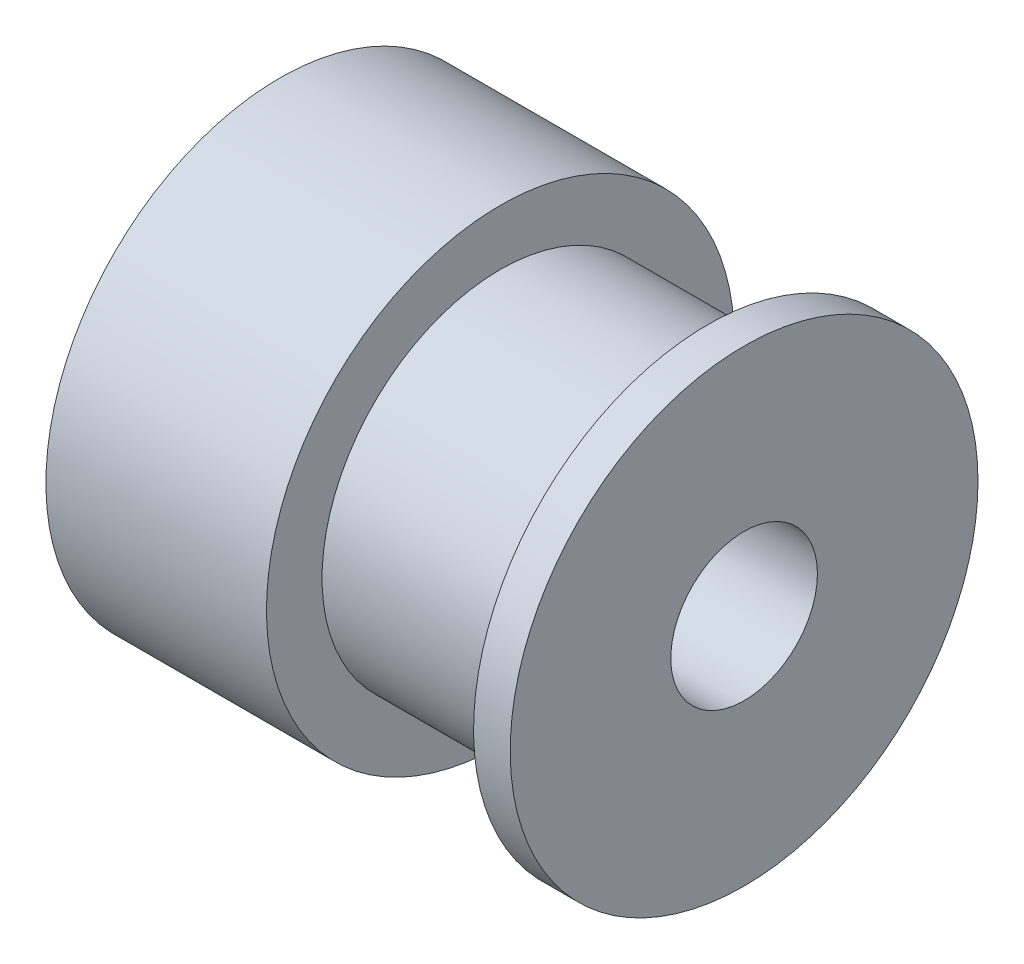
ISO-10303-21;
HEADER;
FILE_DESCRIPTION(('STEP AP214'),'2;1');
FILE_NAME('part.step','',(''),(''),'','','');
FILE_SCHEMA(('AUTOMOTIVE_DESIGN { 1 0 10303 214 1 1 1 1 }'));
ENDSEC;
DATA;
#1=APPLICATION_CONTEXT('core data for automotive mechanical design processes');
#2=APPLICATION_PROTOCOL_DEFINITION('international standard','automotive_design',2000,#1);
#3=PRODUCT_CONTEXT('',#1,'mechanical');
#4=PRODUCT('Part','Part','',(#3));
#5=PRODUCT_RELATED_PRODUCT_CATEGORY('part','',(#4));
#6=PRODUCT_DEFINITION_FORMATION('','',#4);
#7=PRODUCT_DEFINITION_CONTEXT('part definition',#1,'design');
#8=PRODUCT_DEFINITION('design','',#6,#7);
#9=PRODUCT_DEFINITION_SHAPE('','',#8);
#10=(LENGTH_UNIT() NAMED_UNIT(*) SI_UNIT(.MILLI.,.METRE.));
#11=(NAMED_UNIT(*) PLANE_ANGLE_UNIT() SI_UNIT($,.RADIAN.));
#12=(NAMED_UNIT(*) SI_UNIT($,.STERADIAN.) SOLID_ANGLE_UNIT());
#13=UNCERTAINTY_MEASURE_WITH_UNIT(LENGTH_MEASURE(1.E-05),#10,'distance_accuracy_value','');
#14=(GEOMETRIC_REPRESENTATION_CONTEXT(3) GLOBAL_UNCERTAINTY_ASSIGNED_CONTEXT((#13)) GLOBAL_UNIT_ASSIGNED_CONTEXT((#10,
#11,#12)) REPRESENTATION_CONTEXT('',''));
#15=CARTESIAN_POINT('',(0.,0.,0.));
#16=DIRECTION('',(0.,0.,1.));
#17=DIRECTION('',(1.,0.,0.));
#18=AXIS2_PLACEMENT_3D('',#15,#16,#17);
#19=CARTESIAN_POINT('',(15.83,0.,0.));
#20=DIRECTION('',(-1.,0.,0.));
#21=DIRECTION('',(0.,0.,1.));
#22=AXIS2_PLACEMENT_3D('',#19,#20,#21);
#23=CYLINDRICAL_SURFACE('',#22,7.975);
#24=CARTESIAN_POINT('',(0.,0.,0.));
#25=DIRECTION('',(1.,0.,0.));
#26=DIRECTION('',(0.,0.,-1.));
#27=AXIS2_PLACEMENT_3D('',#24,#25,#26);
#28=CIRCLE('',#27,7.975);
#29=CARTESIAN_POINT('',(0.,0.,-7.975));
#30=VERTEX_POINT('',#29);
#31=EDGE_CURVE('E41',#30,#30,#28,.T.);
#32=ORIENTED_EDGE('',*,*,#31,.T.);
#33=EDGE_LOOP('',(#32));
#34=FACE_BOUND('',#33,.T.);
#35=CARTESIAN_POINT('',(7.52,0.,0.));
#36=DIRECTION('',(-1.,0.,0.));
#37=DIRECTION('',(0.,-1.,0.));
#38=AXIS2_PLACEMENT_3D('',#35,#36,#37);
#39=CIRCLE('',#38,7.975);
#40=CARTESIAN_POINT('',(7.52,-7.975,0.));
#41=VERTEX_POINT('',#40);
#42=EDGE_CURVE('E56',#41,#41,#39,.T.);
#43=ORIENTED_EDGE('',*,*,#42,.T.);
#44=EDGE_LOOP('',(#43));
#45=FACE_BOUND('',#44,.T.);
#46=ADVANCED_FACE('F38',(#34,#45),#23,.T.);
#47=CARTESIAN_POINT('',(0.,0.,0.));
#48=DIRECTION('',(1.,0.,0.));
#49=DIRECTION('',(0.,0.,-1.));
#50=AXIS2_PLACEMENT_3D('',#47,#48,#49);
#51=PLANE('',#50);
#52=CARTESIAN_POINT('',(0.,0.,0.));
#53=DIRECTION('',(1.,0.,0.));
#54=DIRECTION('',(0.,0.,-1.));
#55=AXIS2_PLACEMENT_3D('',#52,#53,#54);
#56=CIRCLE('',#55,2.5);
#57=CARTESIAN_POINT('',(0.,0.,-2.5));
#58=VERTEX_POINT('',#57);
#59=EDGE_CURVE('E68',#58,#58,#56,.T.);
#60=ORIENTED_EDGE('',*,*,#59,.T.);
#61=EDGE_LOOP('',(#60));
#62=FACE_BOUND('',#61,.T.);
#63=ORIENTED_EDGE('',*,*,#31,.F.);
#64=EDGE_LOOP('',(#63));
#65=FACE_BOUND('',#64,.T.);
#66=ADVANCED_FACE('F78',(#62,#65),#51,.F.);
#67=CARTESIAN_POINT('',(0.,0.,0.));
#68=DIRECTION('',(-1.,0.,0.));
#69=DIRECTION('',(0.,-1.,0.));
#70=AXIS2_PLACEMENT_3D('',#67,#68,#69);
#71=CYLINDRICAL_SURFACE('',#70,6.08);
#72=CARTESIAN_POINT('',(14.58,0.,0.));
#73=DIRECTION('',(-1.,0.,0.));
#74=DIRECTION('',(0.,-1.,0.));
#75=AXIS2_PLACEMENT_3D('',#72,#73,#74);
#76=CIRCLE('',#75,6.08);
#77=CARTESIAN_POINT('',(14.58,-6.08,0.));
#78=VERTEX_POINT('',#77);
#79=EDGE_CURVE('E64',#78,#78,#76,.T.);
#80=ORIENTED_EDGE('',*,*,#79,.T.);
#81=EDGE_LOOP('',(#80));
#82=FACE_BOUND('',#81,.T.);
#83=CARTESIAN_POINT('',(7.52,0.,0.));
#84=DIRECTION('',(-1.,0.,0.));
#85=DIRECTION('',(0.,-1.,0.));
#86=AXIS2_PLACEMENT_3D('',#83,#84,#85);
#87=CIRCLE('',#86,6.08);
#88=CARTESIAN_POINT('',(7.52,-6.08,0.));
#89=VERTEX_POINT('',#88);
#90=EDGE_CURVE('E51',#89,#89,#87,.T.);
#91=ORIENTED_EDGE('',*,*,#90,.F.);
#92=EDGE_LOOP('',(#91));
#93=FACE_BOUND('',#92,.T.);
#94=ADVANCED_FACE('F106',(#82,#93),#71,.T.);
#95=CARTESIAN_POINT('',(7.52,7.975,0.));
#96=DIRECTION('',(1.,0.,0.));
#97=DIRECTION('',(0.,1.,0.));
#98=AXIS2_PLACEMENT_3D('',#95,#96,#97);
#99=PLANE('',#98);
#100=ORIENTED_EDGE('',*,*,#90,.T.);
#101=EDGE_LOOP('',(#100));
#102=FACE_BOUND('',#101,.T.);
#103=ORIENTED_EDGE('',*,*,#42,.F.);
#104=EDGE_LOOP('',(#103));
#105=FACE_BOUND('',#104,.T.);
#106=ADVANCED_FACE('F97',(#102,#105),#99,.T.);
#107=CARTESIAN_POINT('',(14.58,7.975,0.));
#108=DIRECTION('',(-1.,0.,0.));
#109=DIRECTION('',(0.,-1.,0.));
#110=AXIS2_PLACEMENT_3D('',#107,#108,#109);
#111=PLANE('',#110);
#112=CARTESIAN_POINT('',(14.58,0.,0.));
#113=DIRECTION('',(-1.,0.,0.));
#114=DIRECTION('',(0.,-1.,0.));
#115=AXIS2_PLACEMENT_3D('',#112,#113,#114);
#116=CIRCLE('',#115,7.975);
#117=CARTESIAN_POINT('',(14.58,-7.975,0.));
#118=VERTEX_POINT('',#117);
#119=EDGE_CURVE('E60',#118,#118,#116,.T.);
#120=ORIENTED_EDGE('',*,*,#119,.T.);
#121=EDGE_LOOP('',(#120));
#122=FACE_BOUND('',#121,.T.);
#123=ORIENTED_EDGE('',*,*,#79,.F.);
#124=EDGE_LOOP('',(#123));
#125=FACE_BOUND('',#124,.T.);
#126=ADVANCED_FACE('F90',(#122,#125),#111,.T.);
#127=CARTESIAN_POINT('',(15.83,0.,0.));
#128=DIRECTION('',(1.,0.,0.));
#129=DIRECTION('',(0.,0.,-1.));
#130=AXIS2_PLACEMENT_3D('',#127,#128,#129);
#131=PLANE('',#130);
#132=CARTESIAN_POINT('',(15.83,0.,0.));
#133=DIRECTION('',(1.,0.,0.));
#134=DIRECTION('',(0.,0.,-1.));
#135=AXIS2_PLACEMENT_3D('',#132,#133,#134);
#136=CIRCLE('',#135,2.5);
#137=CARTESIAN_POINT('',(15.83,0.,-2.5));
#138=VERTEX_POINT('',#137);
#139=EDGE_CURVE('E69',#138,#138,#136,.T.);
#140=ORIENTED_EDGE('',*,*,#139,.F.);
#141=EDGE_LOOP('',(#140));
#142=FACE_BOUND('',#141,.T.);
#143=CARTESIAN_POINT('',(15.83,0.,0.));
#144=DIRECTION('',(1.,0.,0.));
#145=DIRECTION('',(0.,0.,-1.));
#146=AXIS2_PLACEMENT_3D('',#143,#144,#145);
#147=CIRCLE('',#146,7.975);
#148=CARTESIAN_POINT('',(15.83,0.,-7.975));
#149=VERTEX_POINT('',#148);
#150=EDGE_CURVE('E10',#149,#149,#147,.T.);
#151=ORIENTED_EDGE('',*,*,#150,.T.);
#152=EDGE_LOOP('',(#151));
#153=FACE_BOUND('',#152,.T.);
#154=ADVANCED_FACE('F88',(#142,#153),#131,.T.);
#155=ORIENTED_EDGE('',*,*,#150,.F.);
#156=EDGE_LOOP('',(#155));
#157=FACE_BOUND('',#156,.T.);
#158=ORIENTED_EDGE('',*,*,#119,.F.);
#159=EDGE_LOOP('',(#158));
#160=FACE_BOUND('',#159,.T.);
#161=ADVANCED_FACE('F84',(#157,#160),#23,.T.);
#162=CARTESIAN_POINT('',(0.,0.,0.));
#163=DIRECTION('',(1.,0.,0.));
#164=DIRECTION('',(0.,0.,-1.));
#165=AXIS2_PLACEMENT_3D('',#162,#163,#164);
#166=CYLINDRICAL_SURFACE('',#165,2.5);
#167=ORIENTED_EDGE('',*,*,#59,.F.);
#168=EDGE_LOOP('',(#167));
#169=FACE_BOUND('',#168,.T.);
#170=ORIENTED_EDGE('',*,*,#139,.T.);
#171=EDGE_LOOP('',(#170));
#172=FACE_BOUND('',#171,.T.);
#173=ADVANCED_FACE('F81',(#169,#172),#166,.F.);
#174=CLOSED_SHELL('',(#46,#66,#94,#106,#126,#154,#161,#173));
#175=MANIFOLD_SOLID_BREP('B2',#174);
#176=ADVANCED_BREP_SHAPE_REPRESENTATION('',(#18,#175),#14);
#177=SHAPE_DEFINITION_REPRESENTATION(#9,#176);
ENDSEC;
END-ISO-10303-21;
